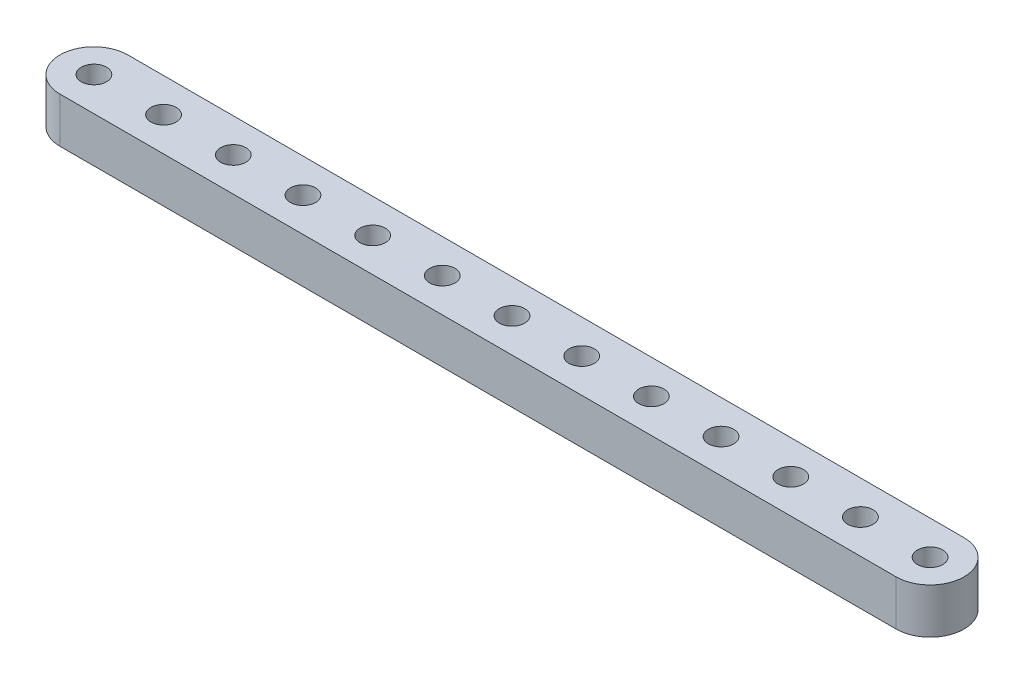
ISO-10303-21;
HEADER;
FILE_DESCRIPTION(('STEP AP214'),'2;1');
FILE_NAME('part.step','',(''),(''),'','','');
FILE_SCHEMA(('AUTOMOTIVE_DESIGN { 1 0 10303 214 1 1 1 1 }'));
ENDSEC;
DATA;
#1=APPLICATION_CONTEXT('core data for automotive mechanical design processes');
#2=APPLICATION_PROTOCOL_DEFINITION('international standard','automotive_design',2000,#1);
#3=PRODUCT_CONTEXT('',#1,'mechanical');
#4=PRODUCT('Part','Part','',(#3));
#5=PRODUCT_RELATED_PRODUCT_CATEGORY('part','',(#4));
#6=PRODUCT_DEFINITION_FORMATION('','',#4);
#7=PRODUCT_DEFINITION_CONTEXT('part definition',#1,'design');
#8=PRODUCT_DEFINITION('design','',#6,#7);
#9=PRODUCT_DEFINITION_SHAPE('','',#8);
#10=(LENGTH_UNIT() NAMED_UNIT(*) SI_UNIT(.MILLI.,.METRE.));
#11=(NAMED_UNIT(*) PLANE_ANGLE_UNIT() SI_UNIT($,.RADIAN.));
#12=(NAMED_UNIT(*) SI_UNIT($,.STERADIAN.) SOLID_ANGLE_UNIT());
#13=UNCERTAINTY_MEASURE_WITH_UNIT(LENGTH_MEASURE(1.E-05),#10,'distance_accuracy_value','');
#14=(GEOMETRIC_REPRESENTATION_CONTEXT(3) GLOBAL_UNCERTAINTY_ASSIGNED_CONTEXT((#13)) GLOBAL_UNIT_ASSIGNED_CONTEXT((#10,
#11,#12)) REPRESENTATION_CONTEXT('',''));
#15=CARTESIAN_POINT('',(0.,0.,0.));
#16=DIRECTION('',(0.,0.,1.));
#17=DIRECTION('',(1.,0.,0.));
#18=AXIS2_PLACEMENT_3D('',#15,#16,#17);
#19=CARTESIAN_POINT('',(-58.674,6.35,0.));
#20=DIRECTION('',(0.,-1.,0.));
#21=DIRECTION('',(0.,0.,-1.));
#22=AXIS2_PLACEMENT_3D('',#19,#20,#21);
#23=CYLINDRICAL_SURFACE('',#22,4.76250000000001);
#24=CARTESIAN_POINT('',(-58.674,0.,0.));
#25=DIRECTION('',(0.,-1.,0.));
#26=DIRECTION('',(0.,0.,-1.));
#27=AXIS2_PLACEMENT_3D('',#24,#25,#26);
#28=CIRCLE('',#27,4.76250000000001);
#29=CARTESIAN_POINT('',(-58.674,0.,4.76250000000001));
#30=VERTEX_POINT('',#29);
#31=CARTESIAN_POINT('',(-58.674,0.,-4.76250000000001));
#32=VERTEX_POINT('',#31);
#33=EDGE_CURVE('E97',#30,#32,#28,.T.);
#34=ORIENTED_EDGE('',*,*,#33,.F.);
#35=DIRECTION('',(0.,-1.,0.));
#36=VECTOR('',#35,1.);
#37=CARTESIAN_POINT('',(-58.674,6.35,4.76250000000001));
#38=LINE('',#37,#36);
#39=CARTESIAN_POINT('',(-58.674,6.35,4.76250000000001));
#40=VERTEX_POINT('',#39);
#41=EDGE_CURVE('E11',#40,#30,#38,.T.);
#42=ORIENTED_EDGE('',*,*,#41,.F.);
#43=CARTESIAN_POINT('',(-58.674,6.35,0.));
#44=DIRECTION('',(0.,-1.,0.));
#45=DIRECTION('',(0.,0.,-1.));
#46=AXIS2_PLACEMENT_3D('',#43,#44,#45);
#47=CIRCLE('',#46,4.76250000000001);
#48=CARTESIAN_POINT('',(-58.674,6.35,-4.76250000000001));
#49=VERTEX_POINT('',#48);
#50=EDGE_CURVE('E90',#40,#49,#47,.T.);
#51=ORIENTED_EDGE('',*,*,#50,.T.);
#52=DIRECTION('',(0.,-1.,0.));
#53=VECTOR('',#52,1.);
#54=CARTESIAN_POINT('',(-58.674,6.35,-4.76250000000001));
#55=LINE('',#54,#53);
#56=EDGE_CURVE('E35',#49,#32,#55,.T.);
#57=ORIENTED_EDGE('',*,*,#56,.T.);
#58=EDGE_LOOP('',(#34,#42,#51,#57));
#59=FACE_BOUND('',#58,.T.);
#60=ADVANCED_FACE('F32',(#59),#23,.T.);
#61=CARTESIAN_POINT('',(58.674,6.35,4.76250000000002));
#62=DIRECTION('',(0.,0.,1.));
#63=DIRECTION('',(1.,0.,0.));
#64=AXIS2_PLACEMENT_3D('',#61,#62,#63);
#65=PLANE('',#64);
#66=DIRECTION('',(-1.,0.,0.));
#67=VECTOR('',#66,1.);
#68=CARTESIAN_POINT('',(58.674,0.,4.76250000000002));
#69=LINE('',#68,#67);
#70=CARTESIAN_POINT('',(58.674,0.,4.76250000000002));
#71=VERTEX_POINT('',#70);
#72=EDGE_CURVE('E92',#71,#30,#69,.T.);
#73=ORIENTED_EDGE('',*,*,#72,.F.);
#74=DIRECTION('',(0.,-1.,0.));
#75=VECTOR('',#74,1.);
#76=CARTESIAN_POINT('',(58.674,6.35,4.76250000000002));
#77=LINE('',#76,#75);
#78=CARTESIAN_POINT('',(58.674,6.35,4.76250000000002));
#79=VERTEX_POINT('',#78);
#80=EDGE_CURVE('E41',#79,#71,#77,.T.);
#81=ORIENTED_EDGE('',*,*,#80,.F.);
#82=DIRECTION('',(-1.,0.,0.));
#83=VECTOR('',#82,1.);
#84=CARTESIAN_POINT('',(58.674,6.35,4.76250000000002));
#85=LINE('',#84,#83);
#86=EDGE_CURVE('E87',#79,#40,#85,.T.);
#87=ORIENTED_EDGE('',*,*,#86,.T.);
#88=ORIENTED_EDGE('',*,*,#41,.T.);
#89=EDGE_LOOP('',(#73,#81,#87,#88));
#90=FACE_BOUND('',#89,.T.);
#91=ADVANCED_FACE('F108',(#90),#65,.T.);
#92=CARTESIAN_POINT('',(58.674,6.35,0.));
#93=DIRECTION('',(0.,-1.,0.));
#94=DIRECTION('',(0.,0.,-1.));
#95=AXIS2_PLACEMENT_3D('',#92,#93,#94);
#96=CYLINDRICAL_SURFACE('',#95,4.76250000000001);
#97=CARTESIAN_POINT('',(58.674,0.,0.));
#98=DIRECTION('',(0.,-1.,0.));
#99=DIRECTION('',(0.,0.,-1.));
#100=AXIS2_PLACEMENT_3D('',#97,#98,#99);
#101=CIRCLE('',#100,4.76250000000001);
#102=CARTESIAN_POINT('',(58.674,0.,-4.76250000000001));
#103=VERTEX_POINT('',#102);
#104=EDGE_CURVE('E82',#103,#71,#101,.T.);
#105=ORIENTED_EDGE('',*,*,#104,.F.);
#106=DIRECTION('',(0.,-1.,0.));
#107=VECTOR('',#106,1.);
#108=CARTESIAN_POINT('',(58.674,6.35,-4.76250000000001));
#109=LINE('',#108,#107);
#110=CARTESIAN_POINT('',(58.674,6.35,-4.76250000000001));
#111=VERTEX_POINT('',#110);
#112=EDGE_CURVE('E77',#111,#103,#109,.T.);
#113=ORIENTED_EDGE('',*,*,#112,.F.);
#114=CARTESIAN_POINT('',(58.674,6.35,0.));
#115=DIRECTION('',(0.,-1.,0.));
#116=DIRECTION('',(0.,0.,-1.));
#117=AXIS2_PLACEMENT_3D('',#114,#115,#116);
#118=CIRCLE('',#117,4.76250000000001);
#119=EDGE_CURVE('E80',#111,#79,#118,.T.);
#120=ORIENTED_EDGE('',*,*,#119,.T.);
#121=ORIENTED_EDGE('',*,*,#80,.T.);
#122=EDGE_LOOP('',(#105,#113,#120,#121));
#123=FACE_BOUND('',#122,.T.);
#124=ADVANCED_FACE('F79',(#123),#96,.T.);
#125=CARTESIAN_POINT('',(-58.674,6.35,-4.76250000000001));
#126=DIRECTION('',(0.,0.,-1.));
#127=DIRECTION('',(-1.,0.,0.));
#128=AXIS2_PLACEMENT_3D('',#125,#126,#127);
#129=PLANE('',#128);
#130=DIRECTION('',(1.,0.,0.));
#131=VECTOR('',#130,1.);
#132=CARTESIAN_POINT('',(-58.674,0.,-4.76250000000001));
#133=LINE('',#132,#131);
#134=EDGE_CURVE('E100',#32,#103,#133,.T.);
#135=ORIENTED_EDGE('',*,*,#134,.F.);
#136=ORIENTED_EDGE('',*,*,#56,.F.);
#137=DIRECTION('',(1.,0.,0.));
#138=VECTOR('',#137,1.);
#139=CARTESIAN_POINT('',(-58.674,6.35,-4.76250000000001));
#140=LINE('',#139,#138);
#141=EDGE_CURVE('E86',#49,#111,#140,.T.);
#142=ORIENTED_EDGE('',*,*,#141,.T.);
#143=ORIENTED_EDGE('',*,*,#112,.T.);
#144=EDGE_LOOP('',(#135,#136,#142,#143));
#145=FACE_BOUND('',#144,.T.);
#146=ADVANCED_FACE('F89',(#145),#129,.T.);
#147=CARTESIAN_POINT('',(-58.674,6.35,0.));
#148=DIRECTION('',(0.,-1.,0.));
#149=DIRECTION('',(0.,0.,-1.));
#150=AXIS2_PLACEMENT_3D('',#147,#148,#149);
#151=PLANE('',#150);
#152=CARTESIAN_POINT('',(-58.674,6.35,0.));
#153=DIRECTION('',(0.,-1.,0.));
#154=DIRECTION('',(0.,0.,1.));
#155=AXIS2_PLACEMENT_3D('',#152,#153,#154);
#156=CIRCLE('',#155,1.77799999999998);
#157=CARTESIAN_POINT('',(-58.674,6.35,1.77799999999999));
#158=VERTEX_POINT('',#157);
#159=EDGE_CURVE('E185',#158,#158,#156,.T.);
#160=ORIENTED_EDGE('',*,*,#159,.T.);
#161=EDGE_LOOP('',(#160));
#162=FACE_BOUND('',#161,.T.);
#163=CARTESIAN_POINT('',(-48.895,6.35,0.));
#164=DIRECTION('',(0.,-1.,0.));
#165=DIRECTION('',(0.,0.,1.));
#166=AXIS2_PLACEMENT_3D('',#163,#164,#165);
#167=CIRCLE('',#166,1.77799999999999);
#168=CARTESIAN_POINT('',(-48.895,6.35,1.77799999999999));
#169=VERTEX_POINT('',#168);
#170=EDGE_CURVE('E193',#169,#169,#167,.T.);
#171=ORIENTED_EDGE('',*,*,#170,.T.);
#172=EDGE_LOOP('',(#171));
#173=FACE_BOUND('',#172,.T.);
#174=CARTESIAN_POINT('',(-39.116,6.35,0.));
#175=DIRECTION('',(0.,-1.,0.));
#176=DIRECTION('',(0.,0.,1.));
#177=AXIS2_PLACEMENT_3D('',#174,#175,#176);
#178=CIRCLE('',#177,1.77799999999999);
#179=CARTESIAN_POINT('',(-39.116,6.35,1.77799999999999));
#180=VERTEX_POINT('',#179);
#181=EDGE_CURVE('E199',#180,#180,#178,.T.);
#182=ORIENTED_EDGE('',*,*,#181,.T.);
#183=EDGE_LOOP('',(#182));
#184=FACE_BOUND('',#183,.T.);
#185=CARTESIAN_POINT('',(-29.337,6.35,0.));
#186=DIRECTION('',(0.,-1.,0.));
#187=DIRECTION('',(0.,0.,1.));
#188=AXIS2_PLACEMENT_3D('',#185,#186,#187);
#189=CIRCLE('',#188,1.77799999999999);
#190=CARTESIAN_POINT('',(-29.337,6.35,1.77799999999999));
#191=VERTEX_POINT('',#190);
#192=EDGE_CURVE('E205',#191,#191,#189,.T.);
#193=ORIENTED_EDGE('',*,*,#192,.T.);
#194=EDGE_LOOP('',(#193));
#195=FACE_BOUND('',#194,.T.);
#196=CARTESIAN_POINT('',(-19.558,6.35,0.));
#197=DIRECTION('',(0.,-1.,0.));
#198=DIRECTION('',(0.,0.,1.));
#199=AXIS2_PLACEMENT_3D('',#196,#197,#198);
#200=CIRCLE('',#199,1.77799999999999);
#201=CARTESIAN_POINT('',(-19.558,6.35,1.77799999999999));
#202=VERTEX_POINT('',#201);
#203=EDGE_CURVE('E211',#202,#202,#200,.T.);
#204=ORIENTED_EDGE('',*,*,#203,.T.);
#205=EDGE_LOOP('',(#204));
#206=FACE_BOUND('',#205,.T.);
#207=CARTESIAN_POINT('',(-9.77900000000001,6.35,0.));
#208=DIRECTION('',(0.,-1.,0.));
#209=DIRECTION('',(0.,0.,1.));
#210=AXIS2_PLACEMENT_3D('',#207,#208,#209);
#211=CIRCLE('',#210,1.77799999999999);
#212=CARTESIAN_POINT('',(-9.77900000000001,6.35,1.77799999999999));
#213=VERTEX_POINT('',#212);
#214=EDGE_CURVE('E217',#213,#213,#211,.T.);
#215=ORIENTED_EDGE('',*,*,#214,.T.);
#216=EDGE_LOOP('',(#215));
#217=FACE_BOUND('',#216,.T.);
#218=CARTESIAN_POINT('',(0.,6.35,0.));
#219=DIRECTION('',(0.,-1.,0.));
#220=DIRECTION('',(0.,0.,1.));
#221=AXIS2_PLACEMENT_3D('',#218,#219,#220);
#222=CIRCLE('',#221,1.77799999999999);
#223=CARTESIAN_POINT('',(0.,6.35,1.77799999999999));
#224=VERTEX_POINT('',#223);
#225=EDGE_CURVE('E223',#224,#224,#222,.T.);
#226=ORIENTED_EDGE('',*,*,#225,.T.);
#227=EDGE_LOOP('',(#226));
#228=FACE_BOUND('',#227,.T.);
#229=CARTESIAN_POINT('',(9.779,6.35,0.));
#230=DIRECTION('',(0.,-1.,0.));
#231=DIRECTION('',(0.,0.,1.));
#232=AXIS2_PLACEMENT_3D('',#229,#230,#231);
#233=CIRCLE('',#232,1.77799999999999);
#234=CARTESIAN_POINT('',(9.779,6.35,1.77799999999999));
#235=VERTEX_POINT('',#234);
#236=EDGE_CURVE('E229',#235,#235,#233,.T.);
#237=ORIENTED_EDGE('',*,*,#236,.T.);
#238=EDGE_LOOP('',(#237));
#239=FACE_BOUND('',#238,.T.);
#240=CARTESIAN_POINT('',(19.558,6.35,0.));
#241=DIRECTION('',(0.,-1.,0.));
#242=DIRECTION('',(0.,0.,1.));
#243=AXIS2_PLACEMENT_3D('',#240,#241,#242);
#244=CIRCLE('',#243,1.77799999999999);
#245=CARTESIAN_POINT('',(19.558,6.35,1.77799999999999));
#246=VERTEX_POINT('',#245);
#247=EDGE_CURVE('E235',#246,#246,#244,.T.);
#248=ORIENTED_EDGE('',*,*,#247,.T.);
#249=EDGE_LOOP('',(#248));
#250=FACE_BOUND('',#249,.T.);
#251=CARTESIAN_POINT('',(29.337,6.35,0.));
#252=DIRECTION('',(0.,-1.,0.));
#253=DIRECTION('',(0.,0.,1.));
#254=AXIS2_PLACEMENT_3D('',#251,#252,#253);
#255=CIRCLE('',#254,1.77799999999999);
#256=CARTESIAN_POINT('',(29.337,6.35,1.778));
#257=VERTEX_POINT('',#256);
#258=EDGE_CURVE('E241',#257,#257,#255,.T.);
#259=ORIENTED_EDGE('',*,*,#258,.T.);
#260=EDGE_LOOP('',(#259));
#261=FACE_BOUND('',#260,.T.);
#262=CARTESIAN_POINT('',(39.116,6.35,0.));
#263=DIRECTION('',(0.,-1.,0.));
#264=DIRECTION('',(0.,0.,1.));
#265=AXIS2_PLACEMENT_3D('',#262,#263,#264);
#266=CIRCLE('',#265,1.77799999999999);
#267=CARTESIAN_POINT('',(39.116,6.35,1.778));
#268=VERTEX_POINT('',#267);
#269=EDGE_CURVE('E247',#268,#268,#266,.T.);
#270=ORIENTED_EDGE('',*,*,#269,.T.);
#271=EDGE_LOOP('',(#270));
#272=FACE_BOUND('',#271,.T.);
#273=CARTESIAN_POINT('',(48.895,6.35,0.));
#274=DIRECTION('',(0.,-1.,0.));
#275=DIRECTION('',(0.,0.,1.));
#276=AXIS2_PLACEMENT_3D('',#273,#274,#275);
#277=CIRCLE('',#276,1.77799999999999);
#278=CARTESIAN_POINT('',(48.895,6.35,1.778));
#279=VERTEX_POINT('',#278);
#280=EDGE_CURVE('E253',#279,#279,#277,.T.);
#281=ORIENTED_EDGE('',*,*,#280,.T.);
#282=EDGE_LOOP('',(#281));
#283=FACE_BOUND('',#282,.T.);
#284=CARTESIAN_POINT('',(58.674,6.35,0.));
#285=DIRECTION('',(0.,-1.,0.));
#286=DIRECTION('',(0.,0.,1.));
#287=AXIS2_PLACEMENT_3D('',#284,#285,#286);
#288=CIRCLE('',#287,1.77799999999999);
#289=CARTESIAN_POINT('',(58.674,6.35,1.778));
#290=VERTEX_POINT('',#289);
#291=EDGE_CURVE('E101',#290,#290,#288,.T.);
#292=ORIENTED_EDGE('',*,*,#291,.T.);
#293=EDGE_LOOP('',(#292));
#294=FACE_BOUND('',#293,.T.);
#295=ORIENTED_EDGE('',*,*,#50,.F.);
#296=ORIENTED_EDGE('',*,*,#86,.F.);
#297=ORIENTED_EDGE('',*,*,#119,.F.);
#298=ORIENTED_EDGE('',*,*,#141,.F.);
#299=EDGE_LOOP('',(#295,#296,#297,#298));
#300=FACE_BOUND('',#299,.T.);
#301=ADVANCED_FACE('F85',(#162,#173,#184,#195,#206,#217,#228,#239,#250,#261,#272,#283,#294,
#300),#151,.F.);
#302=CARTESIAN_POINT('',(-58.674,0.,0.));
#303=DIRECTION('',(0.,-1.,0.));
#304=DIRECTION('',(0.,0.,-1.));
#305=AXIS2_PLACEMENT_3D('',#302,#303,#304);
#306=PLANE('',#305);
#307=CARTESIAN_POINT('',(-58.674,0.,0.));
#308=DIRECTION('',(0.,-1.,0.));
#309=DIRECTION('',(0.,0.,1.));
#310=AXIS2_PLACEMENT_3D('',#307,#308,#309);
#311=CIRCLE('',#310,1.77799999999998);
#312=CARTESIAN_POINT('',(-58.674,0.,1.77799999999999));
#313=VERTEX_POINT('',#312);
#314=EDGE_CURVE('E188',#313,#313,#311,.T.);
#315=ORIENTED_EDGE('',*,*,#314,.F.);
#316=EDGE_LOOP('',(#315));
#317=FACE_BOUND('',#316,.T.);
#318=CARTESIAN_POINT('',(-48.895,0.,0.));
#319=DIRECTION('',(0.,-1.,0.));
#320=DIRECTION('',(0.,0.,1.));
#321=AXIS2_PLACEMENT_3D('',#318,#319,#320);
#322=CIRCLE('',#321,1.77799999999999);
#323=CARTESIAN_POINT('',(-48.895,0.,1.77799999999999));
#324=VERTEX_POINT('',#323);
#325=EDGE_CURVE('E190',#324,#324,#322,.T.);
#326=ORIENTED_EDGE('',*,*,#325,.F.);
#327=EDGE_LOOP('',(#326));
#328=FACE_BOUND('',#327,.T.);
#329=CARTESIAN_POINT('',(-39.116,0.,0.));
#330=DIRECTION('',(0.,-1.,0.));
#331=DIRECTION('',(0.,0.,1.));
#332=AXIS2_PLACEMENT_3D('',#329,#330,#331);
#333=CIRCLE('',#332,1.77799999999999);
#334=CARTESIAN_POINT('',(-39.116,0.,1.77799999999999));
#335=VERTEX_POINT('',#334);
#336=EDGE_CURVE('E196',#335,#335,#333,.T.);
#337=ORIENTED_EDGE('',*,*,#336,.F.);
#338=EDGE_LOOP('',(#337));
#339=FACE_BOUND('',#338,.T.);
#340=CARTESIAN_POINT('',(-29.337,0.,0.));
#341=DIRECTION('',(0.,-1.,0.));
#342=DIRECTION('',(0.,0.,1.));
#343=AXIS2_PLACEMENT_3D('',#340,#341,#342);
#344=CIRCLE('',#343,1.77799999999999);
#345=CARTESIAN_POINT('',(-29.337,0.,1.77799999999999));
#346=VERTEX_POINT('',#345);
#347=EDGE_CURVE('E202',#346,#346,#344,.T.);
#348=ORIENTED_EDGE('',*,*,#347,.F.);
#349=EDGE_LOOP('',(#348));
#350=FACE_BOUND('',#349,.T.);
#351=CARTESIAN_POINT('',(-19.558,0.,0.));
#352=DIRECTION('',(0.,-1.,0.));
#353=DIRECTION('',(0.,0.,1.));
#354=AXIS2_PLACEMENT_3D('',#351,#352,#353);
#355=CIRCLE('',#354,1.77799999999999);
#356=CARTESIAN_POINT('',(-19.558,0.,1.77799999999999));
#357=VERTEX_POINT('',#356);
#358=EDGE_CURVE('E208',#357,#357,#355,.T.);
#359=ORIENTED_EDGE('',*,*,#358,.F.);
#360=EDGE_LOOP('',(#359));
#361=FACE_BOUND('',#360,.T.);
#362=CARTESIAN_POINT('',(-9.77900000000001,0.,0.));
#363=DIRECTION('',(0.,-1.,0.));
#364=DIRECTION('',(0.,0.,1.));
#365=AXIS2_PLACEMENT_3D('',#362,#363,#364);
#366=CIRCLE('',#365,1.77799999999999);
#367=CARTESIAN_POINT('',(-9.77900000000001,0.,1.77799999999999));
#368=VERTEX_POINT('',#367);
#369=EDGE_CURVE('E214',#368,#368,#366,.T.);
#370=ORIENTED_EDGE('',*,*,#369,.F.);
#371=EDGE_LOOP('',(#370));
#372=FACE_BOUND('',#371,.T.);
#373=CARTESIAN_POINT('',(0.,0.,0.));
#374=DIRECTION('',(0.,-1.,0.));
#375=DIRECTION('',(0.,0.,1.));
#376=AXIS2_PLACEMENT_3D('',#373,#374,#375);
#377=CIRCLE('',#376,1.77799999999999);
#378=CARTESIAN_POINT('',(0.,0.,1.77799999999999));
#379=VERTEX_POINT('',#378);
#380=EDGE_CURVE('E220',#379,#379,#377,.T.);
#381=ORIENTED_EDGE('',*,*,#380,.F.);
#382=EDGE_LOOP('',(#381));
#383=FACE_BOUND('',#382,.T.);
#384=CARTESIAN_POINT('',(9.779,0.,0.));
#385=DIRECTION('',(0.,-1.,0.));
#386=DIRECTION('',(0.,0.,1.));
#387=AXIS2_PLACEMENT_3D('',#384,#385,#386);
#388=CIRCLE('',#387,1.77799999999999);
#389=CARTESIAN_POINT('',(9.779,0.,1.77799999999999));
#390=VERTEX_POINT('',#389);
#391=EDGE_CURVE('E226',#390,#390,#388,.T.);
#392=ORIENTED_EDGE('',*,*,#391,.F.);
#393=EDGE_LOOP('',(#392));
#394=FACE_BOUND('',#393,.T.);
#395=CARTESIAN_POINT('',(19.558,0.,0.));
#396=DIRECTION('',(0.,-1.,0.));
#397=DIRECTION('',(0.,0.,1.));
#398=AXIS2_PLACEMENT_3D('',#395,#396,#397);
#399=CIRCLE('',#398,1.77799999999999);
#400=CARTESIAN_POINT('',(19.558,0.,1.77799999999999));
#401=VERTEX_POINT('',#400);
#402=EDGE_CURVE('E232',#401,#401,#399,.T.);
#403=ORIENTED_EDGE('',*,*,#402,.F.);
#404=EDGE_LOOP('',(#403));
#405=FACE_BOUND('',#404,.T.);
#406=CARTESIAN_POINT('',(29.337,0.,0.));
#407=DIRECTION('',(0.,-1.,0.));
#408=DIRECTION('',(0.,0.,1.));
#409=AXIS2_PLACEMENT_3D('',#406,#407,#408);
#410=CIRCLE('',#409,1.77799999999999);
#411=CARTESIAN_POINT('',(29.337,0.,1.778));
#412=VERTEX_POINT('',#411);
#413=EDGE_CURVE('E238',#412,#412,#410,.T.);
#414=ORIENTED_EDGE('',*,*,#413,.F.);
#415=EDGE_LOOP('',(#414));
#416=FACE_BOUND('',#415,.T.);
#417=CARTESIAN_POINT('',(39.116,0.,0.));
#418=DIRECTION('',(0.,-1.,0.));
#419=DIRECTION('',(0.,0.,1.));
#420=AXIS2_PLACEMENT_3D('',#417,#418,#419);
#421=CIRCLE('',#420,1.77799999999999);
#422=CARTESIAN_POINT('',(39.116,0.,1.778));
#423=VERTEX_POINT('',#422);
#424=EDGE_CURVE('E244',#423,#423,#421,.T.);
#425=ORIENTED_EDGE('',*,*,#424,.F.);
#426=EDGE_LOOP('',(#425));
#427=FACE_BOUND('',#426,.T.);
#428=CARTESIAN_POINT('',(48.895,0.,0.));
#429=DIRECTION('',(0.,-1.,0.));
#430=DIRECTION('',(0.,0.,1.));
#431=AXIS2_PLACEMENT_3D('',#428,#429,#430);
#432=CIRCLE('',#431,1.77799999999999);
#433=CARTESIAN_POINT('',(48.895,0.,1.778));
#434=VERTEX_POINT('',#433);
#435=EDGE_CURVE('E250',#434,#434,#432,.T.);
#436=ORIENTED_EDGE('',*,*,#435,.F.);
#437=EDGE_LOOP('',(#436));
#438=FACE_BOUND('',#437,.T.);
#439=CARTESIAN_POINT('',(58.674,0.,0.));
#440=DIRECTION('',(0.,-1.,0.));
#441=DIRECTION('',(0.,0.,1.));
#442=AXIS2_PLACEMENT_3D('',#439,#440,#441);
#443=CIRCLE('',#442,1.77799999999999);
#444=CARTESIAN_POINT('',(58.674,0.,1.778));
#445=VERTEX_POINT('',#444);
#446=EDGE_CURVE('E256',#445,#445,#443,.T.);
#447=ORIENTED_EDGE('',*,*,#446,.F.);
#448=EDGE_LOOP('',(#447));
#449=FACE_BOUND('',#448,.T.);
#450=ORIENTED_EDGE('',*,*,#33,.T.);
#451=ORIENTED_EDGE('',*,*,#134,.T.);
#452=ORIENTED_EDGE('',*,*,#104,.T.);
#453=ORIENTED_EDGE('',*,*,#72,.T.);
#454=EDGE_LOOP('',(#450,#451,#452,#453));
#455=FACE_BOUND('',#454,.T.);
#456=ADVANCED_FACE('F107',(#317,#328,#339,#350,#361,#372,#383,#394,#405,#416,#427,#438,#449,
#455),#306,.T.);
#457=CARTESIAN_POINT('',(58.674,6.35,0.));
#458=DIRECTION('',(0.,-1.,0.));
#459=DIRECTION('',(0.,0.,-1.));
#460=AXIS2_PLACEMENT_3D('',#457,#458,#459);
#461=CYLINDRICAL_SURFACE('',#460,1.77799999999999);
#462=ORIENTED_EDGE('',*,*,#291,.F.);
#463=EDGE_LOOP('',(#462));
#464=FACE_BOUND('',#463,.T.);
#465=ORIENTED_EDGE('',*,*,#446,.T.);
#466=EDGE_LOOP('',(#465));
#467=FACE_BOUND('',#466,.T.);
#468=ADVANCED_FACE('F126',(#464,#467),#461,.F.);
#469=CARTESIAN_POINT('',(48.895,6.35,0.));
#470=DIRECTION('',(0.,-1.,0.));
#471=DIRECTION('',(0.,0.,-1.));
#472=AXIS2_PLACEMENT_3D('',#469,#470,#471);
#473=CYLINDRICAL_SURFACE('',#472,1.77799999999999);
#474=ORIENTED_EDGE('',*,*,#280,.F.);
#475=EDGE_LOOP('',(#474));
#476=FACE_BOUND('',#475,.T.);
#477=ORIENTED_EDGE('',*,*,#435,.T.);
#478=EDGE_LOOP('',(#477));
#479=FACE_BOUND('',#478,.T.);
#480=ADVANCED_FACE('F133',(#476,#479),#473,.F.);
#481=CARTESIAN_POINT('',(39.116,6.35,0.));
#482=DIRECTION('',(0.,-1.,0.));
#483=DIRECTION('',(0.,0.,-1.));
#484=AXIS2_PLACEMENT_3D('',#481,#482,#483);
#485=CYLINDRICAL_SURFACE('',#484,1.77799999999999);
#486=ORIENTED_EDGE('',*,*,#269,.F.);
#487=EDGE_LOOP('',(#486));
#488=FACE_BOUND('',#487,.T.);
#489=ORIENTED_EDGE('',*,*,#424,.T.);
#490=EDGE_LOOP('',(#489));
#491=FACE_BOUND('',#490,.T.);
#492=ADVANCED_FACE('F137',(#488,#491),#485,.F.);
#493=CARTESIAN_POINT('',(29.337,6.35,0.));
#494=DIRECTION('',(0.,-1.,0.));
#495=DIRECTION('',(0.,0.,-1.));
#496=AXIS2_PLACEMENT_3D('',#493,#494,#495);
#497=CYLINDRICAL_SURFACE('',#496,1.77799999999999);
#498=ORIENTED_EDGE('',*,*,#258,.F.);
#499=EDGE_LOOP('',(#498));
#500=FACE_BOUND('',#499,.T.);
#501=ORIENTED_EDGE('',*,*,#413,.T.);
#502=EDGE_LOOP('',(#501));
#503=FACE_BOUND('',#502,.T.);
#504=ADVANCED_FACE('F141',(#500,#503),#497,.F.);
#505=CARTESIAN_POINT('',(19.558,6.35,0.));
#506=DIRECTION('',(0.,-1.,0.));
#507=DIRECTION('',(0.,0.,-1.));
#508=AXIS2_PLACEMENT_3D('',#505,#506,#507);
#509=CYLINDRICAL_SURFACE('',#508,1.77799999999999);
#510=ORIENTED_EDGE('',*,*,#247,.F.);
#511=EDGE_LOOP('',(#510));
#512=FACE_BOUND('',#511,.T.);
#513=ORIENTED_EDGE('',*,*,#402,.T.);
#514=EDGE_LOOP('',(#513));
#515=FACE_BOUND('',#514,.T.);
#516=ADVANCED_FACE('F145',(#512,#515),#509,.F.);
#517=CARTESIAN_POINT('',(9.779,6.35,0.));
#518=DIRECTION('',(0.,-1.,0.));
#519=DIRECTION('',(0.,0.,-1.));
#520=AXIS2_PLACEMENT_3D('',#517,#518,#519);
#521=CYLINDRICAL_SURFACE('',#520,1.77799999999999);
#522=ORIENTED_EDGE('',*,*,#236,.F.);
#523=EDGE_LOOP('',(#522));
#524=FACE_BOUND('',#523,.T.);
#525=ORIENTED_EDGE('',*,*,#391,.T.);
#526=EDGE_LOOP('',(#525));
#527=FACE_BOUND('',#526,.T.);
#528=ADVANCED_FACE('F149',(#524,#527),#521,.F.);
#529=CARTESIAN_POINT('',(0.,6.35,0.));
#530=DIRECTION('',(0.,-1.,0.));
#531=DIRECTION('',(0.,0.,-1.));
#532=AXIS2_PLACEMENT_3D('',#529,#530,#531);
#533=CYLINDRICAL_SURFACE('',#532,1.77799999999999);
#534=ORIENTED_EDGE('',*,*,#225,.F.);
#535=EDGE_LOOP('',(#534));
#536=FACE_BOUND('',#535,.T.);
#537=ORIENTED_EDGE('',*,*,#380,.T.);
#538=EDGE_LOOP('',(#537));
#539=FACE_BOUND('',#538,.T.);
#540=ADVANCED_FACE('F153',(#536,#539),#533,.F.);
#541=CARTESIAN_POINT('',(-9.77900000000001,6.35,0.));
#542=DIRECTION('',(0.,-1.,0.));
#543=DIRECTION('',(0.,0.,-1.));
#544=AXIS2_PLACEMENT_3D('',#541,#542,#543);
#545=CYLINDRICAL_SURFACE('',#544,1.77799999999999);
#546=ORIENTED_EDGE('',*,*,#214,.F.);
#547=EDGE_LOOP('',(#546));
#548=FACE_BOUND('',#547,.T.);
#549=ORIENTED_EDGE('',*,*,#369,.T.);
#550=EDGE_LOOP('',(#549));
#551=FACE_BOUND('',#550,.T.);
#552=ADVANCED_FACE('F157',(#548,#551),#545,.F.);
#553=CARTESIAN_POINT('',(-19.558,6.35,0.));
#554=DIRECTION('',(0.,-1.,0.));
#555=DIRECTION('',(0.,0.,-1.));
#556=AXIS2_PLACEMENT_3D('',#553,#554,#555);
#557=CYLINDRICAL_SURFACE('',#556,1.77799999999999);
#558=ORIENTED_EDGE('',*,*,#203,.F.);
#559=EDGE_LOOP('',(#558));
#560=FACE_BOUND('',#559,.T.);
#561=ORIENTED_EDGE('',*,*,#358,.T.);
#562=EDGE_LOOP('',(#561));
#563=FACE_BOUND('',#562,.T.);
#564=ADVANCED_FACE('F161',(#560,#563),#557,.F.);
#565=CARTESIAN_POINT('',(-29.337,6.35,0.));
#566=DIRECTION('',(0.,-1.,0.));
#567=DIRECTION('',(0.,0.,-1.));
#568=AXIS2_PLACEMENT_3D('',#565,#566,#567);
#569=CYLINDRICAL_SURFACE('',#568,1.77799999999999);
#570=ORIENTED_EDGE('',*,*,#192,.F.);
#571=EDGE_LOOP('',(#570));
#572=FACE_BOUND('',#571,.T.);
#573=ORIENTED_EDGE('',*,*,#347,.T.);
#574=EDGE_LOOP('',(#573));
#575=FACE_BOUND('',#574,.T.);
#576=ADVANCED_FACE('F165',(#572,#575),#569,.F.);
#577=CARTESIAN_POINT('',(-39.116,6.35,0.));
#578=DIRECTION('',(0.,-1.,0.));
#579=DIRECTION('',(0.,0.,-1.));
#580=AXIS2_PLACEMENT_3D('',#577,#578,#579);
#581=CYLINDRICAL_SURFACE('',#580,1.77799999999999);
#582=ORIENTED_EDGE('',*,*,#181,.F.);
#583=EDGE_LOOP('',(#582));
#584=FACE_BOUND('',#583,.T.);
#585=ORIENTED_EDGE('',*,*,#336,.T.);
#586=EDGE_LOOP('',(#585));
#587=FACE_BOUND('',#586,.T.);
#588=ADVANCED_FACE('F169',(#584,#587),#581,.F.);
#589=CARTESIAN_POINT('',(-48.895,6.35,0.));
#590=DIRECTION('',(0.,-1.,0.));
#591=DIRECTION('',(0.,0.,-1.));
#592=AXIS2_PLACEMENT_3D('',#589,#590,#591);
#593=CYLINDRICAL_SURFACE('',#592,1.77799999999999);
#594=ORIENTED_EDGE('',*,*,#170,.F.);
#595=EDGE_LOOP('',(#594));
#596=FACE_BOUND('',#595,.T.);
#597=ORIENTED_EDGE('',*,*,#325,.T.);
#598=EDGE_LOOP('',(#597));
#599=FACE_BOUND('',#598,.T.);
#600=ADVANCED_FACE('F173',(#596,#599),#593,.F.);
#601=CARTESIAN_POINT('',(-58.674,6.35,0.));
#602=DIRECTION('',(0.,-1.,0.));
#603=DIRECTION('',(0.,0.,-1.));
#604=AXIS2_PLACEMENT_3D('',#601,#602,#603);
#605=CYLINDRICAL_SURFACE('',#604,1.77799999999998);
#606=ORIENTED_EDGE('',*,*,#159,.F.);
#607=EDGE_LOOP('',(#606));
#608=FACE_BOUND('',#607,.T.);
#609=ORIENTED_EDGE('',*,*,#314,.T.);
#610=EDGE_LOOP('',(#609));
#611=FACE_BOUND('',#610,.T.);
#612=ADVANCED_FACE('F177',(#608,#611),#605,.F.);
#613=CLOSED_SHELL('',(#60,#91,#124,#146,#301,#456,#468,#480,#492,#504,#516,#528,#540,#552,#564,
#576,#588,#600,#612));
#614=MANIFOLD_SOLID_BREP('B2',#613);
#615=ADVANCED_BREP_SHAPE_REPRESENTATION('',(#18,#614),#14);
#616=SHAPE_DEFINITION_REPRESENTATION(#9,#615);
ENDSEC;
END-ISO-10303-21;
